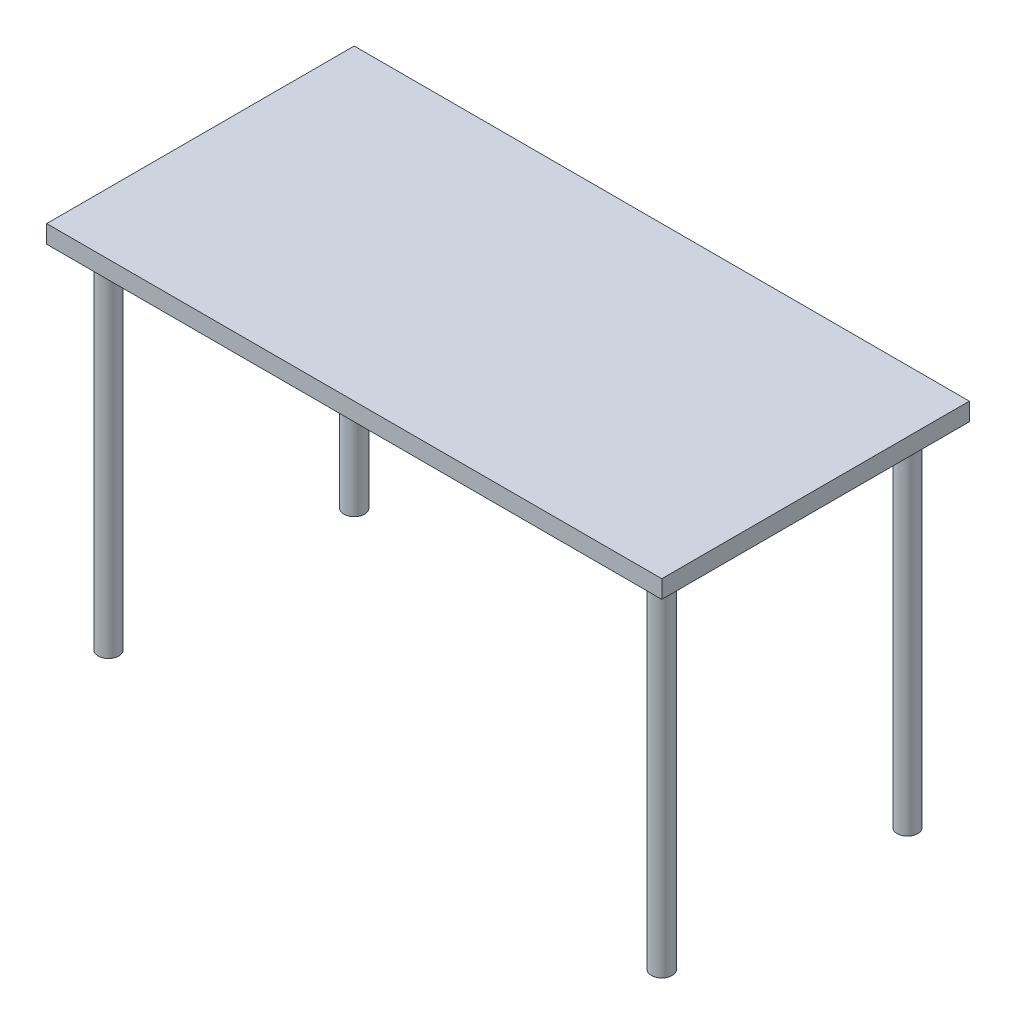
ISO-10303-21;
HEADER;
FILE_DESCRIPTION(('STEP AP214'),'2;1');
FILE_NAME('part.step','',(''),(''),'','','');
FILE_SCHEMA(('AUTOMOTIVE_DESIGN { 1 0 10303 214 1 1 1 1 }'));
ENDSEC;
DATA;
#1=APPLICATION_CONTEXT('core data for automotive mechanical design processes');
#2=APPLICATION_PROTOCOL_DEFINITION('international standard','automotive_design',2000,#1);
#3=PRODUCT_CONTEXT('',#1,'mechanical');
#4=PRODUCT('Part','Part','',(#3));
#5=PRODUCT_RELATED_PRODUCT_CATEGORY('part','',(#4));
#6=PRODUCT_DEFINITION_FORMATION('','',#4);
#7=PRODUCT_DEFINITION_CONTEXT('part definition',#1,'design');
#8=PRODUCT_DEFINITION('design','',#6,#7);
#9=PRODUCT_DEFINITION_SHAPE('','',#8);
#10=(LENGTH_UNIT() NAMED_UNIT(*) SI_UNIT(.MILLI.,.METRE.));
#11=(NAMED_UNIT(*) PLANE_ANGLE_UNIT() SI_UNIT($,.RADIAN.));
#12=(NAMED_UNIT(*) SI_UNIT($,.STERADIAN.) SOLID_ANGLE_UNIT());
#13=UNCERTAINTY_MEASURE_WITH_UNIT(LENGTH_MEASURE(1.E-05),#10,'distance_accuracy_value','');
#14=(GEOMETRIC_REPRESENTATION_CONTEXT(3) GLOBAL_UNCERTAINTY_ASSIGNED_CONTEXT((#13)) GLOBAL_UNIT_ASSIGNED_CONTEXT((#10,
#11,#12)) REPRESENTATION_CONTEXT('',''));
#15=CARTESIAN_POINT('',(0.,0.,0.));
#16=DIRECTION('',(0.,0.,1.));
#17=DIRECTION('',(1.,0.,0.));
#18=AXIS2_PLACEMENT_3D('',#15,#16,#17);
#19=CARTESIAN_POINT('',(-600.075,34.925,300.0375));
#20=DIRECTION('',(1.,0.,0.));
#21=DIRECTION('',(0.,0.,-1.));
#22=AXIS2_PLACEMENT_3D('',#19,#20,#21);
#23=PLANE('',#22);
#24=DIRECTION('',(0.,0.,1.));
#25=VECTOR('',#24,1.);
#26=CARTESIAN_POINT('',(-600.075,0.,300.0375));
#27=LINE('',#26,#25);
#28=CARTESIAN_POINT('',(-600.075,0.,-300.0375));
#29=VERTEX_POINT('',#28);
#30=CARTESIAN_POINT('',(-600.075,0.,300.0375));
#31=VERTEX_POINT('',#30);
#32=EDGE_CURVE('E105',#29,#31,#27,.T.);
#33=ORIENTED_EDGE('',*,*,#32,.T.);
#34=DIRECTION('',(0.,-1.,0.));
#35=VECTOR('',#34,1.);
#36=CARTESIAN_POINT('',(-600.075,34.925,300.0375));
#37=LINE('',#36,#35);
#38=CARTESIAN_POINT('',(-600.075,34.925,300.0375));
#39=VERTEX_POINT('',#38);
#40=EDGE_CURVE('E96',#39,#31,#37,.T.);
#41=ORIENTED_EDGE('',*,*,#40,.F.);
#42=DIRECTION('',(0.,0.,1.));
#43=VECTOR('',#42,1.);
#44=CARTESIAN_POINT('',(-600.075,34.925,300.0375));
#45=LINE('',#44,#43);
#46=CARTESIAN_POINT('',(-600.075,34.925,-300.0375));
#47=VERTEX_POINT('',#46);
#48=EDGE_CURVE('E90',#47,#39,#45,.T.);
#49=ORIENTED_EDGE('',*,*,#48,.F.);
#50=DIRECTION('',(0.,-1.,0.));
#51=VECTOR('',#50,1.);
#52=CARTESIAN_POINT('',(-600.075,34.925,-300.0375));
#53=LINE('',#52,#51);
#54=EDGE_CURVE('E101',#47,#29,#53,.T.);
#55=ORIENTED_EDGE('',*,*,#54,.T.);
#56=EDGE_LOOP('',(#33,#41,#49,#55));
#57=FACE_BOUND('',#56,.T.);
#58=ADVANCED_FACE('F38',(#57),#23,.F.);
#59=CARTESIAN_POINT('',(600.075,34.925,300.0375));
#60=DIRECTION('',(0.,0.,-1.));
#61=DIRECTION('',(-1.,0.,0.));
#62=AXIS2_PLACEMENT_3D('',#59,#60,#61);
#63=PLANE('',#62);
#64=DIRECTION('',(1.,0.,0.));
#65=VECTOR('',#64,1.);
#66=CARTESIAN_POINT('',(600.075,0.,300.0375));
#67=LINE('',#66,#65);
#68=CARTESIAN_POINT('',(600.075,0.,300.0375));
#69=VERTEX_POINT('',#68);
#70=EDGE_CURVE('E95',#31,#69,#67,.T.);
#71=ORIENTED_EDGE('',*,*,#70,.T.);
#72=DIRECTION('',(0.,-1.,0.));
#73=VECTOR('',#72,1.);
#74=CARTESIAN_POINT('',(600.075,34.925,300.0375));
#75=LINE('',#74,#73);
#76=CARTESIAN_POINT('',(600.075,34.925,300.0375));
#77=VERTEX_POINT('',#76);
#78=EDGE_CURVE('E93',#77,#69,#75,.T.);
#79=ORIENTED_EDGE('',*,*,#78,.F.);
#80=DIRECTION('',(1.,0.,0.));
#81=VECTOR('',#80,1.);
#82=CARTESIAN_POINT('',(600.075,34.925,300.0375));
#83=LINE('',#82,#81);
#84=EDGE_CURVE('E85',#39,#77,#83,.T.);
#85=ORIENTED_EDGE('',*,*,#84,.F.);
#86=ORIENTED_EDGE('',*,*,#40,.T.);
#87=EDGE_LOOP('',(#71,#79,#85,#86));
#88=FACE_BOUND('',#87,.T.);
#89=ADVANCED_FACE('F94',(#88),#63,.F.);
#90=CARTESIAN_POINT('',(600.075,34.925,300.0375));
#91=DIRECTION('',(-1.,0.,0.));
#92=DIRECTION('',(0.,0.,1.));
#93=AXIS2_PLACEMENT_3D('',#90,#91,#92);
#94=PLANE('',#93);
#95=DIRECTION('',(0.,0.,-1.));
#96=VECTOR('',#95,1.);
#97=CARTESIAN_POINT('',(600.075,0.,300.0375));
#98=LINE('',#97,#96);
#99=CARTESIAN_POINT('',(600.075,0.,-300.0375));
#100=VERTEX_POINT('',#99);
#101=EDGE_CURVE('E71',#69,#100,#98,.T.);
#102=ORIENTED_EDGE('',*,*,#101,.T.);
#103=DIRECTION('',(0.,-1.,0.));
#104=VECTOR('',#103,1.);
#105=CARTESIAN_POINT('',(600.075,34.925,-300.0375));
#106=LINE('',#105,#104);
#107=CARTESIAN_POINT('',(600.075,34.925,-300.0375));
#108=VERTEX_POINT('',#107);
#109=EDGE_CURVE('E97',#108,#100,#106,.T.);
#110=ORIENTED_EDGE('',*,*,#109,.F.);
#111=DIRECTION('',(0.,0.,-1.));
#112=VECTOR('',#111,1.);
#113=CARTESIAN_POINT('',(600.075,34.925,300.0375));
#114=LINE('',#113,#112);
#115=EDGE_CURVE('E88',#77,#108,#114,.T.);
#116=ORIENTED_EDGE('',*,*,#115,.F.);
#117=ORIENTED_EDGE('',*,*,#78,.T.);
#118=EDGE_LOOP('',(#102,#110,#116,#117));
#119=FACE_BOUND('',#118,.T.);
#120=ADVANCED_FACE('F99',(#119),#94,.F.);
#121=CARTESIAN_POINT('',(600.075,34.925,-300.0375));
#122=DIRECTION('',(0.,0.,1.));
#123=DIRECTION('',(1.,0.,0.));
#124=AXIS2_PLACEMENT_3D('',#121,#122,#123);
#125=PLANE('',#124);
#126=DIRECTION('',(-1.,0.,0.));
#127=VECTOR('',#126,1.);
#128=CARTESIAN_POINT('',(600.075,0.,-300.0375));
#129=LINE('',#128,#127);
#130=EDGE_CURVE('E77',#100,#29,#129,.T.);
#131=ORIENTED_EDGE('',*,*,#130,.T.);
#132=ORIENTED_EDGE('',*,*,#54,.F.);
#133=DIRECTION('',(-1.,0.,0.));
#134=VECTOR('',#133,1.);
#135=CARTESIAN_POINT('',(600.075,34.925,-300.0375));
#136=LINE('',#135,#134);
#137=EDGE_CURVE('E54',#108,#47,#136,.T.);
#138=ORIENTED_EDGE('',*,*,#137,.F.);
#139=ORIENTED_EDGE('',*,*,#109,.T.);
#140=EDGE_LOOP('',(#131,#132,#138,#139));
#141=FACE_BOUND('',#140,.T.);
#142=ADVANCED_FACE('F197',(#141),#125,.F.);
#143=CARTESIAN_POINT('',(0.,34.925,0.));
#144=DIRECTION('',(0.,1.,0.));
#145=DIRECTION('',(0.,0.,1.));
#146=AXIS2_PLACEMENT_3D('',#143,#144,#145);
#147=PLANE('',#146);
#148=ORIENTED_EDGE('',*,*,#48,.T.);
#149=ORIENTED_EDGE('',*,*,#84,.T.);
#150=ORIENTED_EDGE('',*,*,#115,.T.);
#151=ORIENTED_EDGE('',*,*,#137,.T.);
#152=EDGE_LOOP('',(#148,#149,#150,#151));
#153=FACE_BOUND('',#152,.T.);
#154=ADVANCED_FACE('F86',(#153),#147,.T.);
#155=CARTESIAN_POINT('',(0.,0.,0.));
#156=DIRECTION('',(0.,1.,0.));
#157=DIRECTION('',(0.,0.,1.));
#158=AXIS2_PLACEMENT_3D('',#155,#156,#157);
#159=PLANE('',#158);
#160=CARTESIAN_POINT('',(-539.75,0.,-239.7125));
#161=DIRECTION('',(0.,1.,0.));
#162=DIRECTION('',(0.,0.,1.));
#163=AXIS2_PLACEMENT_3D('',#160,#161,#162);
#164=CIRCLE('',#163,51.9630000108);
#165=CARTESIAN_POINT('',(-539.75,0.,-187.7494999892));
#166=VERTEX_POINT('',#165);
#167=EDGE_CURVE('E11',#166,#166,#164,.F.);
#168=ORIENTED_EDGE('',*,*,#167,.F.);
#169=EDGE_LOOP('',(#168));
#170=FACE_BOUND('',#169,.T.);
#171=CARTESIAN_POINT('',(539.75,0.,-239.7125));
#172=DIRECTION('',(0.,1.,0.));
#173=DIRECTION('',(0.,0.,1.));
#174=AXIS2_PLACEMENT_3D('',#171,#172,#173);
#175=CIRCLE('',#174,51.9630000108);
#176=CARTESIAN_POINT('',(539.75,0.,-187.7494999892));
#177=VERTEX_POINT('',#176);
#178=EDGE_CURVE('E46',#177,#177,#175,.F.);
#179=ORIENTED_EDGE('',*,*,#178,.F.);
#180=EDGE_LOOP('',(#179));
#181=FACE_BOUND('',#180,.T.);
#182=CARTESIAN_POINT('',(539.75,0.,239.7125));
#183=DIRECTION('',(0.,1.,0.));
#184=DIRECTION('',(0.,0.,1.));
#185=AXIS2_PLACEMENT_3D('',#182,#183,#184);
#186=CIRCLE('',#185,51.9630000108);
#187=CARTESIAN_POINT('',(539.75,0.,291.6755000108));
#188=VERTEX_POINT('',#187);
#189=EDGE_CURVE('E123',#188,#188,#186,.F.);
#190=ORIENTED_EDGE('',*,*,#189,.F.);
#191=EDGE_LOOP('',(#190));
#192=FACE_BOUND('',#191,.T.);
#193=CARTESIAN_POINT('',(-539.75,0.,239.7125));
#194=DIRECTION('',(0.,1.,0.));
#195=DIRECTION('',(0.,0.,1.));
#196=AXIS2_PLACEMENT_3D('',#193,#194,#195);
#197=CIRCLE('',#196,51.9630000108);
#198=CARTESIAN_POINT('',(-539.75,0.,291.6755000108));
#199=VERTEX_POINT('',#198);
#200=EDGE_CURVE('E115',#199,#199,#197,.F.);
#201=ORIENTED_EDGE('',*,*,#200,.F.);
#202=EDGE_LOOP('',(#201));
#203=FACE_BOUND('',#202,.T.);
#204=ORIENTED_EDGE('',*,*,#32,.F.);
#205=ORIENTED_EDGE('',*,*,#130,.F.);
#206=ORIENTED_EDGE('',*,*,#101,.F.);
#207=ORIENTED_EDGE('',*,*,#70,.F.);
#208=EDGE_LOOP('',(#204,#205,#206,#207));
#209=FACE_BOUND('',#208,.T.);
#210=ADVANCED_FACE('F186',(#170,#181,#192,#203,#209),#159,.F.);
#211=CARTESIAN_POINT('',(-539.75,-1.5875,239.7125));
#212=DIRECTION('',(0.,1.,0.));
#213=DIRECTION('',(0.,0.,1.));
#214=AXIS2_PLACEMENT_3D('',#211,#212,#213);
#215=CYLINDRICAL_SURFACE('',#214,51.9630000108);
#216=CARTESIAN_POINT('',(-539.75,-1.5875,239.7125));
#217=DIRECTION('',(0.,-1.,0.));
#218=DIRECTION('',(0.,0.,-1.));
#219=AXIS2_PLACEMENT_3D('',#216,#217,#218);
#220=CIRCLE('',#219,51.9630000108);
#221=CARTESIAN_POINT('',(-539.75,-1.5875,187.7494999892));
#222=VERTEX_POINT('',#221);
#223=EDGE_CURVE('E120',#222,#222,#220,.T.);
#224=ORIENTED_EDGE('',*,*,#223,.F.);
#225=EDGE_LOOP('',(#224));
#226=FACE_BOUND('',#225,.T.);
#227=ORIENTED_EDGE('',*,*,#200,.T.);
#228=EDGE_LOOP('',(#227));
#229=FACE_BOUND('',#228,.T.);
#230=ADVANCED_FACE('F188',(#226,#229),#215,.T.);
#231=CARTESIAN_POINT('',(-539.75,-1.5875,239.7125));
#232=DIRECTION('',(0.,-1.,0.));
#233=DIRECTION('',(0.,0.,-1.));
#234=AXIS2_PLACEMENT_3D('',#231,#232,#233);
#235=PLANE('',#234);
#236=CARTESIAN_POINT('',(-539.75,-1.58749999999996,239.7125));
#237=DIRECTION('',(0.,-1.,0.));
#238=DIRECTION('',(0.,0.,-1.));
#239=AXIS2_PLACEMENT_3D('',#236,#237,#238);
#240=CIRCLE('',#239,20.2130000107999);
#241=CARTESIAN_POINT('',(-539.75,-1.58749999999996,219.4994999892));
#242=VERTEX_POINT('',#241);
#243=EDGE_CURVE('E116',#242,#242,#240,.T.);
#244=ORIENTED_EDGE('',*,*,#243,.F.);
#245=EDGE_LOOP('',(#244));
#246=FACE_BOUND('',#245,.T.);
#247=ORIENTED_EDGE('',*,*,#223,.T.);
#248=EDGE_LOOP('',(#247));
#249=FACE_BOUND('',#248,.T.);
#250=ADVANCED_FACE('F176',(#246,#249),#235,.T.);
#251=CARTESIAN_POINT('',(-539.75,-685.8,239.7125));
#252=DIRECTION('',(0.,-1.,0.));
#253=DIRECTION('',(0.,0.,-1.));
#254=AXIS2_PLACEMENT_3D('',#251,#252,#253);
#255=PLANE('',#254);
#256=CARTESIAN_POINT('',(-539.75,-685.8,239.7125));
#257=DIRECTION('',(0.,-1.,0.));
#258=DIRECTION('',(0.,0.,-1.));
#259=AXIS2_PLACEMENT_3D('',#256,#257,#258);
#260=CIRCLE('',#259,20.2130000107999);
#261=CARTESIAN_POINT('',(-539.75,-685.8,219.4994999892));
#262=VERTEX_POINT('',#261);
#263=EDGE_CURVE('E108',#262,#262,#260,.T.);
#264=ORIENTED_EDGE('',*,*,#263,.T.);
#265=EDGE_LOOP('',(#264));
#266=FACE_BOUND('',#265,.T.);
#267=ADVANCED_FACE('F162',(#266),#255,.T.);
#268=CARTESIAN_POINT('',(-539.75,-685.8,239.7125));
#269=DIRECTION('',(0.,1.,0.));
#270=DIRECTION('',(0.,0.,1.));
#271=AXIS2_PLACEMENT_3D('',#268,#269,#270);
#272=CYLINDRICAL_SURFACE('',#271,20.2130000107999);
#273=ORIENTED_EDGE('',*,*,#243,.T.);
#274=EDGE_LOOP('',(#273));
#275=FACE_BOUND('',#274,.T.);
#276=ORIENTED_EDGE('',*,*,#263,.F.);
#277=EDGE_LOOP('',(#276));
#278=FACE_BOUND('',#277,.T.);
#279=ADVANCED_FACE('F164',(#275,#278),#272,.T.);
#280=CARTESIAN_POINT('',(539.75,-1.5875,239.7125));
#281=DIRECTION('',(0.,1.,0.));
#282=DIRECTION('',(0.,0.,1.));
#283=AXIS2_PLACEMENT_3D('',#280,#281,#282);
#284=CYLINDRICAL_SURFACE('',#283,51.9630000108);
#285=CARTESIAN_POINT('',(539.75,-1.5875,239.7125));
#286=DIRECTION('',(0.,-1.,0.));
#287=DIRECTION('',(0.,0.,-1.));
#288=AXIS2_PLACEMENT_3D('',#285,#286,#287);
#289=CIRCLE('',#288,51.9630000108);
#290=CARTESIAN_POINT('',(539.75,-1.5875,187.7494999892));
#291=VERTEX_POINT('',#290);
#292=EDGE_CURVE('E127',#291,#291,#289,.T.);
#293=ORIENTED_EDGE('',*,*,#292,.F.);
#294=EDGE_LOOP('',(#293));
#295=FACE_BOUND('',#294,.T.);
#296=ORIENTED_EDGE('',*,*,#189,.T.);
#297=EDGE_LOOP('',(#296));
#298=FACE_BOUND('',#297,.T.);
#299=ADVANCED_FACE('F166',(#295,#298),#284,.T.);
#300=CARTESIAN_POINT('',(539.75,-1.5875,239.7125));
#301=DIRECTION('',(0.,-1.,0.));
#302=DIRECTION('',(0.,0.,-1.));
#303=AXIS2_PLACEMENT_3D('',#300,#301,#302);
#304=PLANE('',#303);
#305=CARTESIAN_POINT('',(539.75,-1.58749999999996,239.7125));
#306=DIRECTION('',(0.,-1.,0.));
#307=DIRECTION('',(0.,0.,-1.));
#308=AXIS2_PLACEMENT_3D('',#305,#306,#307);
#309=CIRCLE('',#308,20.2130000107999);
#310=CARTESIAN_POINT('',(539.75,-1.58749999999996,219.4994999892));
#311=VERTEX_POINT('',#310);
#312=EDGE_CURVE('E124',#311,#311,#309,.T.);
#313=ORIENTED_EDGE('',*,*,#312,.F.);
#314=EDGE_LOOP('',(#313));
#315=FACE_BOUND('',#314,.T.);
#316=ORIENTED_EDGE('',*,*,#292,.T.);
#317=EDGE_LOOP('',(#316));
#318=FACE_BOUND('',#317,.T.);
#319=ADVANCED_FACE('F173',(#315,#318),#304,.T.);
#320=CARTESIAN_POINT('',(539.75,-685.8,239.7125));
#321=DIRECTION('',(0.,-1.,0.));
#322=DIRECTION('',(0.,0.,-1.));
#323=AXIS2_PLACEMENT_3D('',#320,#321,#322);
#324=PLANE('',#323);
#325=CARTESIAN_POINT('',(539.75,-685.8,239.7125));
#326=DIRECTION('',(0.,-1.,0.));
#327=DIRECTION('',(0.,0.,-1.));
#328=AXIS2_PLACEMENT_3D('',#325,#326,#327);
#329=CIRCLE('',#328,20.2130000107999);
#330=CARTESIAN_POINT('',(539.75,-685.8,219.4994999892));
#331=VERTEX_POINT('',#330);
#332=EDGE_CURVE('E156',#331,#331,#329,.T.);
#333=ORIENTED_EDGE('',*,*,#332,.T.);
#334=EDGE_LOOP('',(#333));
#335=FACE_BOUND('',#334,.T.);
#336=ADVANCED_FACE('F231',(#335),#324,.T.);
#337=CARTESIAN_POINT('',(539.75,-685.8,239.7125));
#338=DIRECTION('',(0.,1.,0.));
#339=DIRECTION('',(0.,0.,1.));
#340=AXIS2_PLACEMENT_3D('',#337,#338,#339);
#341=CYLINDRICAL_SURFACE('',#340,20.2130000107999);
#342=ORIENTED_EDGE('',*,*,#312,.T.);
#343=EDGE_LOOP('',(#342));
#344=FACE_BOUND('',#343,.T.);
#345=ORIENTED_EDGE('',*,*,#332,.F.);
#346=EDGE_LOOP('',(#345));
#347=FACE_BOUND('',#346,.T.);
#348=ADVANCED_FACE('F236',(#344,#347),#341,.T.);
#349=CARTESIAN_POINT('',(539.75,-1.5875,-239.7125));
#350=DIRECTION('',(0.,1.,0.));
#351=DIRECTION('',(0.,0.,1.));
#352=AXIS2_PLACEMENT_3D('',#349,#350,#351);
#353=CYLINDRICAL_SURFACE('',#352,51.9630000108);
#354=CARTESIAN_POINT('',(539.75,-1.5875,-239.7125));
#355=DIRECTION('',(0.,-1.,0.));
#356=DIRECTION('',(0.,0.,-1.));
#357=AXIS2_PLACEMENT_3D('',#354,#355,#356);
#358=CIRCLE('',#357,51.9630000108);
#359=CARTESIAN_POINT('',(539.75,-1.5875,-291.6755000108));
#360=VERTEX_POINT('',#359);
#361=EDGE_CURVE('E133',#360,#360,#358,.T.);
#362=ORIENTED_EDGE('',*,*,#361,.F.);
#363=EDGE_LOOP('',(#362));
#364=FACE_BOUND('',#363,.T.);
#365=ORIENTED_EDGE('',*,*,#178,.T.);
#366=EDGE_LOOP('',(#365));
#367=FACE_BOUND('',#366,.T.);
#368=ADVANCED_FACE('F311',(#364,#367),#353,.T.);
#369=CARTESIAN_POINT('',(539.75,-1.5875,-239.7125));
#370=DIRECTION('',(0.,-1.,0.));
#371=DIRECTION('',(0.,0.,-1.));
#372=AXIS2_PLACEMENT_3D('',#369,#370,#371);
#373=PLANE('',#372);
#374=CARTESIAN_POINT('',(539.75,-1.58749999999996,-239.7125));
#375=DIRECTION('',(0.,-1.,0.));
#376=DIRECTION('',(0.,0.,-1.));
#377=AXIS2_PLACEMENT_3D('',#374,#375,#376);
#378=CIRCLE('',#377,20.2130000107999);
#379=CARTESIAN_POINT('',(539.75,-1.58749999999996,-259.9255000108));
#380=VERTEX_POINT('',#379);
#381=EDGE_CURVE('E130',#380,#380,#378,.T.);
#382=ORIENTED_EDGE('',*,*,#381,.F.);
#383=EDGE_LOOP('',(#382));
#384=FACE_BOUND('',#383,.T.);
#385=ORIENTED_EDGE('',*,*,#361,.T.);
#386=EDGE_LOOP('',(#385));
#387=FACE_BOUND('',#386,.T.);
#388=ADVANCED_FACE('F265',(#384,#387),#373,.T.);
#389=CARTESIAN_POINT('',(539.75,-685.8,-239.7125));
#390=DIRECTION('',(0.,-1.,0.));
#391=DIRECTION('',(0.,0.,-1.));
#392=AXIS2_PLACEMENT_3D('',#389,#390,#391);
#393=PLANE('',#392);
#394=CARTESIAN_POINT('',(539.75,-685.8,-239.7125));
#395=DIRECTION('',(0.,-1.,0.));
#396=DIRECTION('',(0.,0.,-1.));
#397=AXIS2_PLACEMENT_3D('',#394,#395,#396);
#398=CIRCLE('',#397,20.2130000107999);
#399=CARTESIAN_POINT('',(539.75,-685.8,-259.9255000108));
#400=VERTEX_POINT('',#399);
#401=EDGE_CURVE('E119',#400,#400,#398,.T.);
#402=ORIENTED_EDGE('',*,*,#401,.T.);
#403=EDGE_LOOP('',(#402));
#404=FACE_BOUND('',#403,.T.);
#405=ADVANCED_FACE('F260',(#404),#393,.T.);
#406=CARTESIAN_POINT('',(539.75,-685.8,-239.7125));
#407=DIRECTION('',(0.,1.,0.));
#408=DIRECTION('',(0.,0.,1.));
#409=AXIS2_PLACEMENT_3D('',#406,#407,#408);
#410=CYLINDRICAL_SURFACE('',#409,20.2130000107999);
#411=ORIENTED_EDGE('',*,*,#381,.T.);
#412=EDGE_LOOP('',(#411));
#413=FACE_BOUND('',#412,.T.);
#414=ORIENTED_EDGE('',*,*,#401,.F.);
#415=EDGE_LOOP('',(#414));
#416=FACE_BOUND('',#415,.T.);
#417=ADVANCED_FACE('F264',(#413,#416),#410,.T.);
#418=CARTESIAN_POINT('',(-539.75,-1.5875,-239.7125));
#419=DIRECTION('',(0.,1.,0.));
#420=DIRECTION('',(0.,0.,1.));
#421=AXIS2_PLACEMENT_3D('',#418,#419,#420);
#422=CYLINDRICAL_SURFACE('',#421,51.9630000108);
#423=CARTESIAN_POINT('',(-539.75,-1.5875,-239.7125));
#424=DIRECTION('',(0.,-1.,0.));
#425=DIRECTION('',(0.,0.,-1.));
#426=AXIS2_PLACEMENT_3D('',#423,#424,#425);
#427=CIRCLE('',#426,51.9630000108);
#428=CARTESIAN_POINT('',(-539.75,-1.5875,-291.6755000108));
#429=VERTEX_POINT('',#428);
#430=EDGE_CURVE('E137',#429,#429,#427,.T.);
#431=ORIENTED_EDGE('',*,*,#430,.F.);
#432=EDGE_LOOP('',(#431));
#433=FACE_BOUND('',#432,.T.);
#434=ORIENTED_EDGE('',*,*,#167,.T.);
#435=EDGE_LOOP('',(#434));
#436=FACE_BOUND('',#435,.T.);
#437=ADVANCED_FACE('F336',(#433,#436),#422,.T.);
#438=CARTESIAN_POINT('',(-539.75,-1.5875,-239.7125));
#439=DIRECTION('',(0.,-1.,0.));
#440=DIRECTION('',(0.,0.,-1.));
#441=AXIS2_PLACEMENT_3D('',#438,#439,#440);
#442=PLANE('',#441);
#443=CARTESIAN_POINT('',(-539.75,-1.58749999999996,-239.7125));
#444=DIRECTION('',(0.,-1.,0.));
#445=DIRECTION('',(0.,0.,-1.));
#446=AXIS2_PLACEMENT_3D('',#443,#444,#445);
#447=CIRCLE('',#446,20.2130000107999);
#448=CARTESIAN_POINT('',(-539.75,-1.58749999999996,-259.9255000108));
#449=VERTEX_POINT('',#448);
#450=EDGE_CURVE('E135',#449,#449,#447,.T.);
#451=ORIENTED_EDGE('',*,*,#450,.F.);
#452=EDGE_LOOP('',(#451));
#453=FACE_BOUND('',#452,.T.);
#454=ORIENTED_EDGE('',*,*,#430,.T.);
#455=EDGE_LOOP('',(#454));
#456=FACE_BOUND('',#455,.T.);
#457=ADVANCED_FACE('F251',(#453,#456),#442,.T.);
#458=CARTESIAN_POINT('',(-539.75,-685.8,-239.7125));
#459=DIRECTION('',(0.,-1.,0.));
#460=DIRECTION('',(0.,0.,-1.));
#461=AXIS2_PLACEMENT_3D('',#458,#459,#460);
#462=PLANE('',#461);
#463=CARTESIAN_POINT('',(-539.75,-685.8,-239.7125));
#464=DIRECTION('',(0.,-1.,0.));
#465=DIRECTION('',(0.,0.,-1.));
#466=AXIS2_PLACEMENT_3D('',#463,#464,#465);
#467=CIRCLE('',#466,20.2130000107999);
#468=CARTESIAN_POINT('',(-539.75,-685.8,-259.9255000108));
#469=VERTEX_POINT('',#468);
#470=EDGE_CURVE('E153',#469,#469,#467,.T.);
#471=ORIENTED_EDGE('',*,*,#470,.T.);
#472=EDGE_LOOP('',(#471));
#473=FACE_BOUND('',#472,.T.);
#474=ADVANCED_FACE('F245',(#473),#462,.T.);
#475=CARTESIAN_POINT('',(-539.75,-685.8,-239.7125));
#476=DIRECTION('',(0.,1.,0.));
#477=DIRECTION('',(0.,0.,1.));
#478=AXIS2_PLACEMENT_3D('',#475,#476,#477);
#479=CYLINDRICAL_SURFACE('',#478,20.2130000107999);
#480=ORIENTED_EDGE('',*,*,#450,.T.);
#481=EDGE_LOOP('',(#480));
#482=FACE_BOUND('',#481,.T.);
#483=ORIENTED_EDGE('',*,*,#470,.F.);
#484=EDGE_LOOP('',(#483));
#485=FACE_BOUND('',#484,.T.);
#486=ADVANCED_FACE('F250',(#482,#485),#479,.T.);
#487=CLOSED_SHELL('',(#58,#89,#120,#142,#154,#210,#230,#250,#267,#279,#299,#319,#336,#348,#368,
#388,#405,#417,#437,#457,#474,#486));
#488=MANIFOLD_SOLID_BREP('B2',#487);
#489=ADVANCED_BREP_SHAPE_REPRESENTATION('',(#18,#488),#14);
#490=SHAPE_DEFINITION_REPRESENTATION(#9,#489);
ENDSEC;
END-ISO-10303-21;
